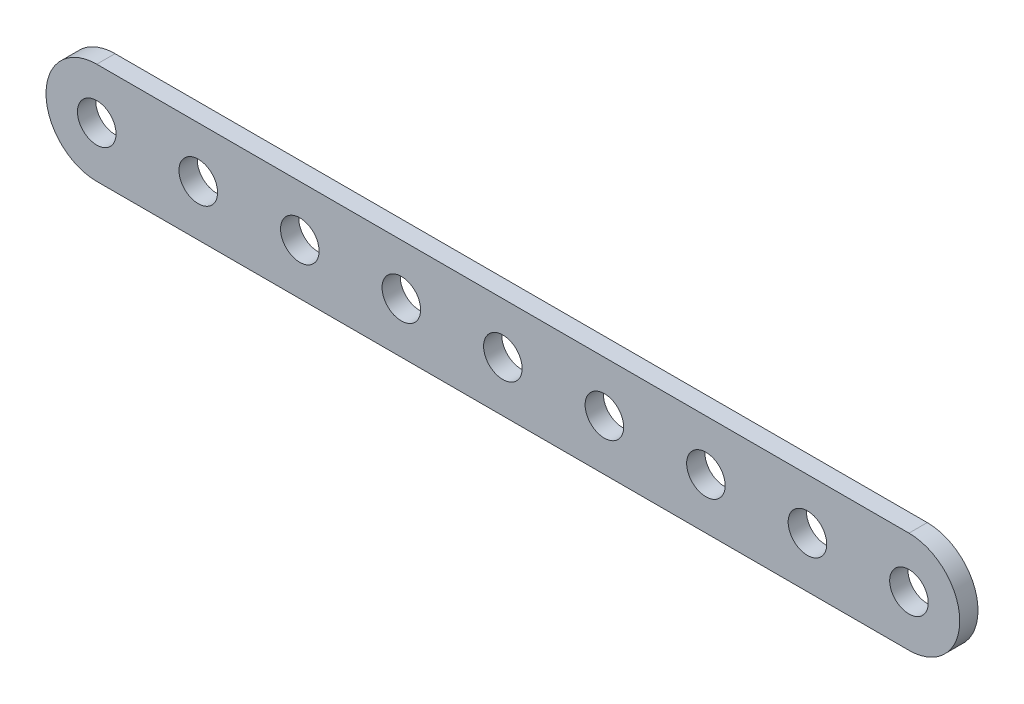
ISO-10303-21;
HEADER;
FILE_DESCRIPTION(('STEP AP214'),'2;1');
FILE_NAME('part.step','',(''),(''),'','','');
FILE_SCHEMA(('AUTOMOTIVE_DESIGN { 1 0 10303 214 1 1 1 1 }'));
ENDSEC;
DATA;
#1=APPLICATION_CONTEXT('core data for automotive mechanical design processes');
#2=APPLICATION_PROTOCOL_DEFINITION('international standard','automotive_design',2000,#1);
#3=PRODUCT_CONTEXT('',#1,'mechanical');
#4=PRODUCT('Part','Part','',(#3));
#5=PRODUCT_RELATED_PRODUCT_CATEGORY('part','',(#4));
#6=PRODUCT_DEFINITION_FORMATION('','',#4);
#7=PRODUCT_DEFINITION_CONTEXT('part definition',#1,'design');
#8=PRODUCT_DEFINITION('design','',#6,#7);
#9=PRODUCT_DEFINITION_SHAPE('','',#8);
#10=(LENGTH_UNIT() NAMED_UNIT(*) SI_UNIT(.MILLI.,.METRE.));
#11=(NAMED_UNIT(*) PLANE_ANGLE_UNIT() SI_UNIT($,.RADIAN.));
#12=(NAMED_UNIT(*) SI_UNIT($,.STERADIAN.) SOLID_ANGLE_UNIT());
#13=UNCERTAINTY_MEASURE_WITH_UNIT(LENGTH_MEASURE(1.E-05),#10,'distance_accuracy_value','');
#14=(GEOMETRIC_REPRESENTATION_CONTEXT(3) GLOBAL_UNCERTAINTY_ASSIGNED_CONTEXT((#13)) GLOBAL_UNIT_ASSIGNED_CONTEXT((#10,
#11,#12)) REPRESENTATION_CONTEXT('',''));
#15=CARTESIAN_POINT('',(0.,0.,0.));
#16=DIRECTION('',(0.,0.,1.));
#17=DIRECTION('',(1.,0.,0.));
#18=AXIS2_PLACEMENT_3D('',#15,#16,#17);
#19=CARTESIAN_POINT('',(-50.8,0.,2.286));
#20=DIRECTION('',(0.,0.,-1.));
#21=DIRECTION('',(-1.,0.,0.));
#22=AXIS2_PLACEMENT_3D('',#19,#20,#21);
#23=CYLINDRICAL_SURFACE('',#22,6.35);
#24=CARTESIAN_POINT('',(-50.8,0.,0.));
#25=DIRECTION('',(0.,0.,1.));
#26=DIRECTION('',(1.,0.,0.));
#27=AXIS2_PLACEMENT_3D('',#24,#25,#26);
#28=CIRCLE('',#27,6.35);
#29=CARTESIAN_POINT('',(-50.8,6.35,0.));
#30=VERTEX_POINT('',#29);
#31=CARTESIAN_POINT('',(-50.8,-6.35,0.));
#32=VERTEX_POINT('',#31);
#33=EDGE_CURVE('E90',#30,#32,#28,.T.);
#34=ORIENTED_EDGE('',*,*,#33,.T.);
#35=DIRECTION('',(0.,0.,-1.));
#36=VECTOR('',#35,1.);
#37=CARTESIAN_POINT('',(-50.8,-6.35,2.286));
#38=LINE('',#37,#36);
#39=CARTESIAN_POINT('',(-50.8,-6.35,2.286));
#40=VERTEX_POINT('',#39);
#41=EDGE_CURVE('E13',#40,#32,#38,.T.);
#42=ORIENTED_EDGE('',*,*,#41,.F.);
#43=CARTESIAN_POINT('',(-50.8,0.,2.286));
#44=DIRECTION('',(0.,0.,1.));
#45=DIRECTION('',(1.,0.,0.));
#46=AXIS2_PLACEMENT_3D('',#43,#44,#45);
#47=CIRCLE('',#46,6.35);
#48=CARTESIAN_POINT('',(-50.8,6.35,2.286));
#49=VERTEX_POINT('',#48);
#50=EDGE_CURVE('E113',#49,#40,#47,.T.);
#51=ORIENTED_EDGE('',*,*,#50,.F.);
#52=DIRECTION('',(0.,0.,-1.));
#53=VECTOR('',#52,1.);
#54=CARTESIAN_POINT('',(-50.8,6.35,2.286));
#55=LINE('',#54,#53);
#56=EDGE_CURVE('E102',#49,#30,#55,.T.);
#57=ORIENTED_EDGE('',*,*,#56,.T.);
#58=EDGE_LOOP('',(#34,#42,#51,#57));
#59=FACE_BOUND('',#58,.T.);
#60=ADVANCED_FACE('F46',(#59),#23,.T.);
#61=CARTESIAN_POINT('',(-50.8,-6.35,2.286));
#62=DIRECTION('',(0.,1.,0.));
#63=DIRECTION('',(0.,0.,1.));
#64=AXIS2_PLACEMENT_3D('',#61,#62,#63);
#65=PLANE('',#64);
#66=DIRECTION('',(1.,0.,0.));
#67=VECTOR('',#66,1.);
#68=CARTESIAN_POINT('',(-50.8,-6.35,0.));
#69=LINE('',#68,#67);
#70=CARTESIAN_POINT('',(50.8,-6.35,0.));
#71=VERTEX_POINT('',#70);
#72=EDGE_CURVE('E86',#32,#71,#69,.T.);
#73=ORIENTED_EDGE('',*,*,#72,.T.);
#74=DIRECTION('',(0.,0.,-1.));
#75=VECTOR('',#74,1.);
#76=CARTESIAN_POINT('',(50.8,-6.35,2.286));
#77=LINE('',#76,#75);
#78=CARTESIAN_POINT('',(50.8,-6.35,2.286));
#79=VERTEX_POINT('',#78);
#80=EDGE_CURVE('E53',#79,#71,#77,.T.);
#81=ORIENTED_EDGE('',*,*,#80,.F.);
#82=DIRECTION('',(1.,0.,0.));
#83=VECTOR('',#82,1.);
#84=CARTESIAN_POINT('',(-50.8,-6.35,2.286));
#85=LINE('',#84,#83);
#86=EDGE_CURVE('E98',#40,#79,#85,.T.);
#87=ORIENTED_EDGE('',*,*,#86,.F.);
#88=ORIENTED_EDGE('',*,*,#41,.T.);
#89=EDGE_LOOP('',(#73,#81,#87,#88));
#90=FACE_BOUND('',#89,.T.);
#91=ADVANCED_FACE('F97',(#90),#65,.F.);
#92=CARTESIAN_POINT('',(50.8,0.,2.286));
#93=DIRECTION('',(0.,0.,-1.));
#94=DIRECTION('',(-1.,0.,0.));
#95=AXIS2_PLACEMENT_3D('',#92,#93,#94);
#96=CYLINDRICAL_SURFACE('',#95,6.35);
#97=CARTESIAN_POINT('',(50.8,0.,0.));
#98=DIRECTION('',(0.,0.,1.));
#99=DIRECTION('',(-1.,0.,0.));
#100=AXIS2_PLACEMENT_3D('',#97,#98,#99);
#101=CIRCLE('',#100,6.35);
#102=CARTESIAN_POINT('',(50.8,6.35,0.));
#103=VERTEX_POINT('',#102);
#104=EDGE_CURVE('E91',#71,#103,#101,.T.);
#105=ORIENTED_EDGE('',*,*,#104,.T.);
#106=DIRECTION('',(0.,0.,-1.));
#107=VECTOR('',#106,1.);
#108=CARTESIAN_POINT('',(50.8,6.35,2.286));
#109=LINE('',#108,#107);
#110=CARTESIAN_POINT('',(50.8,6.35,2.286));
#111=VERTEX_POINT('',#110);
#112=EDGE_CURVE('E119',#111,#103,#109,.T.);
#113=ORIENTED_EDGE('',*,*,#112,.F.);
#114=CARTESIAN_POINT('',(50.8,0.,2.286));
#115=DIRECTION('',(0.,0.,1.));
#116=DIRECTION('',(-1.,0.,0.));
#117=AXIS2_PLACEMENT_3D('',#114,#115,#116);
#118=CIRCLE('',#117,6.35);
#119=EDGE_CURVE('E65',#79,#111,#118,.T.);
#120=ORIENTED_EDGE('',*,*,#119,.F.);
#121=ORIENTED_EDGE('',*,*,#80,.T.);
#122=EDGE_LOOP('',(#105,#113,#120,#121));
#123=FACE_BOUND('',#122,.T.);
#124=ADVANCED_FACE('F122',(#123),#96,.T.);
#125=CARTESIAN_POINT('',(-50.8,6.35,2.286));
#126=DIRECTION('',(0.,-1.,0.));
#127=DIRECTION('',(0.,0.,-1.));
#128=AXIS2_PLACEMENT_3D('',#125,#126,#127);
#129=PLANE('',#128);
#130=DIRECTION('',(-1.,0.,0.));
#131=VECTOR('',#130,1.);
#132=CARTESIAN_POINT('',(-50.8,6.35,0.));
#133=LINE('',#132,#131);
#134=EDGE_CURVE('E111',#103,#30,#133,.T.);
#135=ORIENTED_EDGE('',*,*,#134,.T.);
#136=ORIENTED_EDGE('',*,*,#56,.F.);
#137=DIRECTION('',(-1.,0.,0.));
#138=VECTOR('',#137,1.);
#139=CARTESIAN_POINT('',(-50.8,6.35,2.286));
#140=LINE('',#139,#138);
#141=EDGE_CURVE('E60',#111,#49,#140,.T.);
#142=ORIENTED_EDGE('',*,*,#141,.F.);
#143=ORIENTED_EDGE('',*,*,#112,.T.);
#144=EDGE_LOOP('',(#135,#136,#142,#143));
#145=FACE_BOUND('',#144,.T.);
#146=ADVANCED_FACE('F124',(#145),#129,.F.);
#147=CARTESIAN_POINT('',(-50.8,0.,2.286));
#148=DIRECTION('',(0.,0.,1.));
#149=DIRECTION('',(1.,0.,0.));
#150=AXIS2_PLACEMENT_3D('',#147,#148,#149);
#151=PLANE('',#150);
#152=CARTESIAN_POINT('',(50.8,0.,2.286));
#153=DIRECTION('',(0.,0.,1.));
#154=DIRECTION('',(1.,0.,0.));
#155=AXIS2_PLACEMENT_3D('',#152,#153,#154);
#156=CIRCLE('',#155,2.413);
#157=CARTESIAN_POINT('',(53.213,0.,2.286));
#158=VERTEX_POINT('',#157);
#159=EDGE_CURVE('E261',#158,#158,#156,.T.);
#160=ORIENTED_EDGE('',*,*,#159,.F.);
#161=EDGE_LOOP('',(#160));
#162=FACE_BOUND('',#161,.T.);
#163=CARTESIAN_POINT('',(38.1,0.,2.286));
#164=DIRECTION('',(0.,0.,1.));
#165=DIRECTION('',(1.,0.,0.));
#166=AXIS2_PLACEMENT_3D('',#163,#164,#165);
#167=CIRCLE('',#166,2.413);
#168=CARTESIAN_POINT('',(40.513,0.,2.286));
#169=VERTEX_POINT('',#168);
#170=EDGE_CURVE('E263',#169,#169,#167,.T.);
#171=ORIENTED_EDGE('',*,*,#170,.F.);
#172=EDGE_LOOP('',(#171));
#173=FACE_BOUND('',#172,.T.);
#174=CARTESIAN_POINT('',(25.4,0.,2.286));
#175=DIRECTION('',(0.,0.,1.));
#176=DIRECTION('',(1.,0.,0.));
#177=AXIS2_PLACEMENT_3D('',#174,#175,#176);
#178=CIRCLE('',#177,2.413);
#179=CARTESIAN_POINT('',(27.813,0.,2.286));
#180=VERTEX_POINT('',#179);
#181=EDGE_CURVE('E271',#180,#180,#178,.T.);
#182=ORIENTED_EDGE('',*,*,#181,.F.);
#183=EDGE_LOOP('',(#182));
#184=FACE_BOUND('',#183,.T.);
#185=CARTESIAN_POINT('',(12.7,0.,2.286));
#186=DIRECTION('',(0.,0.,1.));
#187=DIRECTION('',(1.,0.,0.));
#188=AXIS2_PLACEMENT_3D('',#185,#186,#187);
#189=CIRCLE('',#188,2.413);
#190=CARTESIAN_POINT('',(15.113,0.,2.286));
#191=VERTEX_POINT('',#190);
#192=EDGE_CURVE('E277',#191,#191,#189,.T.);
#193=ORIENTED_EDGE('',*,*,#192,.F.);
#194=EDGE_LOOP('',(#193));
#195=FACE_BOUND('',#194,.T.);
#196=CARTESIAN_POINT('',(0.,0.,2.286));
#197=DIRECTION('',(0.,0.,1.));
#198=DIRECTION('',(1.,0.,0.));
#199=AXIS2_PLACEMENT_3D('',#196,#197,#198);
#200=CIRCLE('',#199,2.413);
#201=CARTESIAN_POINT('',(2.413,0.,2.286));
#202=VERTEX_POINT('',#201);
#203=EDGE_CURVE('E283',#202,#202,#200,.T.);
#204=ORIENTED_EDGE('',*,*,#203,.F.);
#205=EDGE_LOOP('',(#204));
#206=FACE_BOUND('',#205,.T.);
#207=CARTESIAN_POINT('',(-12.7,0.,2.286));
#208=DIRECTION('',(0.,0.,1.));
#209=DIRECTION('',(1.,0.,0.));
#210=AXIS2_PLACEMENT_3D('',#207,#208,#209);
#211=CIRCLE('',#210,2.413);
#212=CARTESIAN_POINT('',(-10.287,0.,2.286));
#213=VERTEX_POINT('',#212);
#214=EDGE_CURVE('E289',#213,#213,#211,.T.);
#215=ORIENTED_EDGE('',*,*,#214,.F.);
#216=EDGE_LOOP('',(#215));
#217=FACE_BOUND('',#216,.T.);
#218=CARTESIAN_POINT('',(-25.4,0.,2.286));
#219=DIRECTION('',(0.,0.,1.));
#220=DIRECTION('',(1.,0.,0.));
#221=AXIS2_PLACEMENT_3D('',#218,#219,#220);
#222=CIRCLE('',#221,2.413);
#223=CARTESIAN_POINT('',(-22.987,0.,2.286));
#224=VERTEX_POINT('',#223);
#225=EDGE_CURVE('E295',#224,#224,#222,.T.);
#226=ORIENTED_EDGE('',*,*,#225,.F.);
#227=EDGE_LOOP('',(#226));
#228=FACE_BOUND('',#227,.T.);
#229=CARTESIAN_POINT('',(-38.1,0.,2.286));
#230=DIRECTION('',(0.,0.,1.));
#231=DIRECTION('',(1.,0.,0.));
#232=AXIS2_PLACEMENT_3D('',#229,#230,#231);
#233=CIRCLE('',#232,2.413);
#234=CARTESIAN_POINT('',(-35.687,0.,2.286));
#235=VERTEX_POINT('',#234);
#236=EDGE_CURVE('E301',#235,#235,#233,.T.);
#237=ORIENTED_EDGE('',*,*,#236,.F.);
#238=EDGE_LOOP('',(#237));
#239=FACE_BOUND('',#238,.T.);
#240=CARTESIAN_POINT('',(-50.8,0.,2.286));
#241=DIRECTION('',(0.,0.,1.));
#242=DIRECTION('',(1.,0.,0.));
#243=AXIS2_PLACEMENT_3D('',#240,#241,#242);
#244=CIRCLE('',#243,2.413);
#245=CARTESIAN_POINT('',(-48.387,0.,2.286));
#246=VERTEX_POINT('',#245);
#247=EDGE_CURVE('E106',#246,#246,#244,.T.);
#248=ORIENTED_EDGE('',*,*,#247,.F.);
#249=EDGE_LOOP('',(#248));
#250=FACE_BOUND('',#249,.T.);
#251=ORIENTED_EDGE('',*,*,#50,.T.);
#252=ORIENTED_EDGE('',*,*,#86,.T.);
#253=ORIENTED_EDGE('',*,*,#119,.T.);
#254=ORIENTED_EDGE('',*,*,#141,.T.);
#255=EDGE_LOOP('',(#251,#252,#253,#254));
#256=FACE_BOUND('',#255,.T.);
#257=ADVANCED_FACE('F125',(#162,#173,#184,#195,#206,#217,#228,#239,#250,#256),#151,.T.);
#258=CARTESIAN_POINT('',(-50.8,0.,0.));
#259=DIRECTION('',(0.,0.,1.));
#260=DIRECTION('',(1.,0.,0.));
#261=AXIS2_PLACEMENT_3D('',#258,#259,#260);
#262=PLANE('',#261);
#263=CARTESIAN_POINT('',(50.8,0.,0.));
#264=DIRECTION('',(0.,0.,1.));
#265=DIRECTION('',(1.,0.,0.));
#266=AXIS2_PLACEMENT_3D('',#263,#264,#265);
#267=CIRCLE('',#266,2.413);
#268=CARTESIAN_POINT('',(53.213,0.,0.));
#269=VERTEX_POINT('',#268);
#270=EDGE_CURVE('E259',#269,#269,#267,.T.);
#271=ORIENTED_EDGE('',*,*,#270,.T.);
#272=EDGE_LOOP('',(#271));
#273=FACE_BOUND('',#272,.T.);
#274=CARTESIAN_POINT('',(38.1,0.,0.));
#275=DIRECTION('',(0.,0.,1.));
#276=DIRECTION('',(1.,0.,0.));
#277=AXIS2_PLACEMENT_3D('',#274,#275,#276);
#278=CIRCLE('',#277,2.413);
#279=CARTESIAN_POINT('',(40.513,0.,0.));
#280=VERTEX_POINT('',#279);
#281=EDGE_CURVE('E268',#280,#280,#278,.T.);
#282=ORIENTED_EDGE('',*,*,#281,.T.);
#283=EDGE_LOOP('',(#282));
#284=FACE_BOUND('',#283,.T.);
#285=CARTESIAN_POINT('',(25.4,0.,0.));
#286=DIRECTION('',(0.,0.,1.));
#287=DIRECTION('',(1.,0.,0.));
#288=AXIS2_PLACEMENT_3D('',#285,#286,#287);
#289=CIRCLE('',#288,2.413);
#290=CARTESIAN_POINT('',(27.813,0.,0.));
#291=VERTEX_POINT('',#290);
#292=EDGE_CURVE('E274',#291,#291,#289,.T.);
#293=ORIENTED_EDGE('',*,*,#292,.T.);
#294=EDGE_LOOP('',(#293));
#295=FACE_BOUND('',#294,.T.);
#296=CARTESIAN_POINT('',(12.7,0.,0.));
#297=DIRECTION('',(0.,0.,1.));
#298=DIRECTION('',(1.,0.,0.));
#299=AXIS2_PLACEMENT_3D('',#296,#297,#298);
#300=CIRCLE('',#299,2.413);
#301=CARTESIAN_POINT('',(15.113,0.,0.));
#302=VERTEX_POINT('',#301);
#303=EDGE_CURVE('E280',#302,#302,#300,.T.);
#304=ORIENTED_EDGE('',*,*,#303,.T.);
#305=EDGE_LOOP('',(#304));
#306=FACE_BOUND('',#305,.T.);
#307=CARTESIAN_POINT('',(0.,0.,0.));
#308=DIRECTION('',(0.,0.,1.));
#309=DIRECTION('',(1.,0.,0.));
#310=AXIS2_PLACEMENT_3D('',#307,#308,#309);
#311=CIRCLE('',#310,2.413);
#312=CARTESIAN_POINT('',(2.413,0.,0.));
#313=VERTEX_POINT('',#312);
#314=EDGE_CURVE('E286',#313,#313,#311,.T.);
#315=ORIENTED_EDGE('',*,*,#314,.T.);
#316=EDGE_LOOP('',(#315));
#317=FACE_BOUND('',#316,.T.);
#318=CARTESIAN_POINT('',(-12.7,0.,0.));
#319=DIRECTION('',(0.,0.,1.));
#320=DIRECTION('',(1.,0.,0.));
#321=AXIS2_PLACEMENT_3D('',#318,#319,#320);
#322=CIRCLE('',#321,2.413);
#323=CARTESIAN_POINT('',(-10.287,0.,0.));
#324=VERTEX_POINT('',#323);
#325=EDGE_CURVE('E292',#324,#324,#322,.T.);
#326=ORIENTED_EDGE('',*,*,#325,.T.);
#327=EDGE_LOOP('',(#326));
#328=FACE_BOUND('',#327,.T.);
#329=CARTESIAN_POINT('',(-25.4,0.,0.));
#330=DIRECTION('',(0.,0.,1.));
#331=DIRECTION('',(1.,0.,0.));
#332=AXIS2_PLACEMENT_3D('',#329,#330,#331);
#333=CIRCLE('',#332,2.413);
#334=CARTESIAN_POINT('',(-22.987,0.,0.));
#335=VERTEX_POINT('',#334);
#336=EDGE_CURVE('E298',#335,#335,#333,.T.);
#337=ORIENTED_EDGE('',*,*,#336,.T.);
#338=EDGE_LOOP('',(#337));
#339=FACE_BOUND('',#338,.T.);
#340=CARTESIAN_POINT('',(-38.1,0.,0.));
#341=DIRECTION('',(0.,0.,1.));
#342=DIRECTION('',(1.,0.,0.));
#343=AXIS2_PLACEMENT_3D('',#340,#341,#342);
#344=CIRCLE('',#343,2.413);
#345=CARTESIAN_POINT('',(-35.687,0.,0.));
#346=VERTEX_POINT('',#345);
#347=EDGE_CURVE('E304',#346,#346,#344,.T.);
#348=ORIENTED_EDGE('',*,*,#347,.T.);
#349=EDGE_LOOP('',(#348));
#350=FACE_BOUND('',#349,.T.);
#351=CARTESIAN_POINT('',(-50.8,0.,0.));
#352=DIRECTION('',(0.,0.,1.));
#353=DIRECTION('',(1.,0.,0.));
#354=AXIS2_PLACEMENT_3D('',#351,#352,#353);
#355=CIRCLE('',#354,2.413);
#356=CARTESIAN_POINT('',(-48.387,0.,0.));
#357=VERTEX_POINT('',#356);
#358=EDGE_CURVE('E103',#357,#357,#355,.T.);
#359=ORIENTED_EDGE('',*,*,#358,.T.);
#360=EDGE_LOOP('',(#359));
#361=FACE_BOUND('',#360,.T.);
#362=ORIENTED_EDGE('',*,*,#33,.F.);
#363=ORIENTED_EDGE('',*,*,#134,.F.);
#364=ORIENTED_EDGE('',*,*,#104,.F.);
#365=ORIENTED_EDGE('',*,*,#72,.F.);
#366=EDGE_LOOP('',(#362,#363,#364,#365));
#367=FACE_BOUND('',#366,.T.);
#368=ADVANCED_FACE('F87',(#273,#284,#295,#306,#317,#328,#339,#350,#361,#367),#262,.F.);
#369=CARTESIAN_POINT('',(-50.8,0.,0.));
#370=DIRECTION('',(0.,0.,1.));
#371=DIRECTION('',(1.,0.,0.));
#372=AXIS2_PLACEMENT_3D('',#369,#370,#371);
#373=CYLINDRICAL_SURFACE('',#372,2.413);
#374=ORIENTED_EDGE('',*,*,#358,.F.);
#375=EDGE_LOOP('',(#374));
#376=FACE_BOUND('',#375,.T.);
#377=ORIENTED_EDGE('',*,*,#247,.T.);
#378=EDGE_LOOP('',(#377));
#379=FACE_BOUND('',#378,.T.);
#380=ADVANCED_FACE('F133',(#376,#379),#373,.F.);
#381=CARTESIAN_POINT('',(-38.1,0.,0.));
#382=DIRECTION('',(0.,0.,1.));
#383=DIRECTION('',(1.,0.,0.));
#384=AXIS2_PLACEMENT_3D('',#381,#382,#383);
#385=CYLINDRICAL_SURFACE('',#384,2.413);
#386=ORIENTED_EDGE('',*,*,#347,.F.);
#387=EDGE_LOOP('',(#386));
#388=FACE_BOUND('',#387,.T.);
#389=ORIENTED_EDGE('',*,*,#236,.T.);
#390=EDGE_LOOP('',(#389));
#391=FACE_BOUND('',#390,.T.);
#392=ADVANCED_FACE('F162',(#388,#391),#385,.F.);
#393=CARTESIAN_POINT('',(-25.4,0.,0.));
#394=DIRECTION('',(0.,0.,1.));
#395=DIRECTION('',(1.,0.,0.));
#396=AXIS2_PLACEMENT_3D('',#393,#394,#395);
#397=CYLINDRICAL_SURFACE('',#396,2.413);
#398=ORIENTED_EDGE('',*,*,#336,.F.);
#399=EDGE_LOOP('',(#398));
#400=FACE_BOUND('',#399,.T.);
#401=ORIENTED_EDGE('',*,*,#225,.T.);
#402=EDGE_LOOP('',(#401));
#403=FACE_BOUND('',#402,.T.);
#404=ADVANCED_FACE('F182',(#400,#403),#397,.F.);
#405=CARTESIAN_POINT('',(-12.7,0.,0.));
#406=DIRECTION('',(0.,0.,1.));
#407=DIRECTION('',(1.,0.,0.));
#408=AXIS2_PLACEMENT_3D('',#405,#406,#407);
#409=CYLINDRICAL_SURFACE('',#408,2.413);
#410=ORIENTED_EDGE('',*,*,#325,.F.);
#411=EDGE_LOOP('',(#410));
#412=FACE_BOUND('',#411,.T.);
#413=ORIENTED_EDGE('',*,*,#214,.T.);
#414=EDGE_LOOP('',(#413));
#415=FACE_BOUND('',#414,.T.);
#416=ADVANCED_FACE('F192',(#412,#415),#409,.F.);
#417=CARTESIAN_POINT('',(0.,0.,0.));
#418=DIRECTION('',(0.,0.,1.));
#419=DIRECTION('',(1.,0.,0.));
#420=AXIS2_PLACEMENT_3D('',#417,#418,#419);
#421=CYLINDRICAL_SURFACE('',#420,2.413);
#422=ORIENTED_EDGE('',*,*,#314,.F.);
#423=EDGE_LOOP('',(#422));
#424=FACE_BOUND('',#423,.T.);
#425=ORIENTED_EDGE('',*,*,#203,.T.);
#426=EDGE_LOOP('',(#425));
#427=FACE_BOUND('',#426,.T.);
#428=ADVANCED_FACE('F202',(#424,#427),#421,.F.);
#429=CARTESIAN_POINT('',(12.7,0.,0.));
#430=DIRECTION('',(0.,0.,1.));
#431=DIRECTION('',(1.,0.,0.));
#432=AXIS2_PLACEMENT_3D('',#429,#430,#431);
#433=CYLINDRICAL_SURFACE('',#432,2.413);
#434=ORIENTED_EDGE('',*,*,#303,.F.);
#435=EDGE_LOOP('',(#434));
#436=FACE_BOUND('',#435,.T.);
#437=ORIENTED_EDGE('',*,*,#192,.T.);
#438=EDGE_LOOP('',(#437));
#439=FACE_BOUND('',#438,.T.);
#440=ADVANCED_FACE('F212',(#436,#439),#433,.F.);
#441=CARTESIAN_POINT('',(25.4,0.,0.));
#442=DIRECTION('',(0.,0.,1.));
#443=DIRECTION('',(1.,0.,0.));
#444=AXIS2_PLACEMENT_3D('',#441,#442,#443);
#445=CYLINDRICAL_SURFACE('',#444,2.413);
#446=ORIENTED_EDGE('',*,*,#292,.F.);
#447=EDGE_LOOP('',(#446));
#448=FACE_BOUND('',#447,.T.);
#449=ORIENTED_EDGE('',*,*,#181,.T.);
#450=EDGE_LOOP('',(#449));
#451=FACE_BOUND('',#450,.T.);
#452=ADVANCED_FACE('F222',(#448,#451),#445,.F.);
#453=CARTESIAN_POINT('',(38.1,0.,0.));
#454=DIRECTION('',(0.,0.,1.));
#455=DIRECTION('',(1.,0.,0.));
#456=AXIS2_PLACEMENT_3D('',#453,#454,#455);
#457=CYLINDRICAL_SURFACE('',#456,2.413);
#458=ORIENTED_EDGE('',*,*,#281,.F.);
#459=EDGE_LOOP('',(#458));
#460=FACE_BOUND('',#459,.T.);
#461=ORIENTED_EDGE('',*,*,#170,.T.);
#462=EDGE_LOOP('',(#461));
#463=FACE_BOUND('',#462,.T.);
#464=ADVANCED_FACE('F232',(#460,#463),#457,.F.);
#465=CARTESIAN_POINT('',(50.8,0.,0.));
#466=DIRECTION('',(0.,0.,1.));
#467=DIRECTION('',(1.,0.,0.));
#468=AXIS2_PLACEMENT_3D('',#465,#466,#467);
#469=CYLINDRICAL_SURFACE('',#468,2.413);
#470=ORIENTED_EDGE('',*,*,#270,.F.);
#471=EDGE_LOOP('',(#470));
#472=FACE_BOUND('',#471,.T.);
#473=ORIENTED_EDGE('',*,*,#159,.T.);
#474=EDGE_LOOP('',(#473));
#475=FACE_BOUND('',#474,.T.);
#476=ADVANCED_FACE('F242',(#472,#475),#469,.F.);
#477=CLOSED_SHELL('',(#60,#91,#124,#146,#257,#368,#380,#392,#404,#416,#428,#440,#452,#464,#476));
#478=MANIFOLD_SOLID_BREP('B2',#477);
#479=ADVANCED_BREP_SHAPE_REPRESENTATION('',(#18,#478),#14);
#480=SHAPE_DEFINITION_REPRESENTATION(#9,#479);
ENDSEC;
END-ISO-10303-21;
